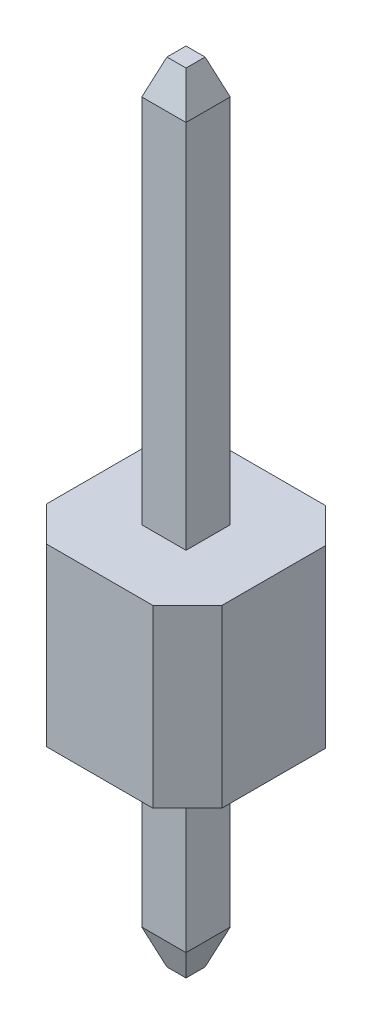
ISO-10303-21;
HEADER;
FILE_DESCRIPTION(('STEP AP214'),'2;1');
FILE_NAME('part.step','',(''),(''),'','','');
FILE_SCHEMA(('AUTOMOTIVE_DESIGN { 1 0 10303 214 1 1 1 1 }'));
ENDSEC;
DATA;
#1=APPLICATION_CONTEXT('core data for automotive mechanical design processes');
#2=APPLICATION_PROTOCOL_DEFINITION('international standard','automotive_design',2000,#1);
#3=PRODUCT_CONTEXT('',#1,'mechanical');
#4=PRODUCT('Part','Part','',(#3));
#5=PRODUCT_RELATED_PRODUCT_CATEGORY('part','',(#4));
#6=PRODUCT_DEFINITION_FORMATION('','',#4);
#7=PRODUCT_DEFINITION_CONTEXT('part definition',#1,'design');
#8=PRODUCT_DEFINITION('design','',#6,#7);
#9=PRODUCT_DEFINITION_SHAPE('','',#8);
#10=(LENGTH_UNIT() NAMED_UNIT(*) SI_UNIT(.MILLI.,.METRE.));
#11=(NAMED_UNIT(*) PLANE_ANGLE_UNIT() SI_UNIT($,.RADIAN.));
#12=(NAMED_UNIT(*) SI_UNIT($,.STERADIAN.) SOLID_ANGLE_UNIT());
#13=UNCERTAINTY_MEASURE_WITH_UNIT(LENGTH_MEASURE(1.E-05),#10,'distance_accuracy_value','');
#14=(GEOMETRIC_REPRESENTATION_CONTEXT(3) GLOBAL_UNCERTAINTY_ASSIGNED_CONTEXT((#13)) GLOBAL_UNIT_ASSIGNED_CONTEXT((#10,
#11,#12)) REPRESENTATION_CONTEXT('',''));
#15=CARTESIAN_POINT('',(0.,0.,0.));
#16=DIRECTION('',(0.,0.,1.));
#17=DIRECTION('',(1.,0.,0.));
#18=AXIS2_PLACEMENT_3D('',#15,#16,#17);
#19=CARTESIAN_POINT('',(-20.5046575219933,-116.166087876259,67.0858140827478));
#20=DIRECTION('',(0.,0.342020143325667,-0.939692620785909));
#21=DIRECTION('',(-1.,0.,0.));
#22=AXIS2_PLACEMENT_3D('',#19,#20,#21);
#23=PLANE('',#22);
#24=DIRECTION('',(0.323615577118189,0.889126490715985,0.323615577118189));
#25=VECTOR('',#24,1.);
#26=CARTESIAN_POINT('',(-20.381096529517,-116.205799613767,67.0713601923572));
#27=LINE('',#26,#25);
#28=CARTESIAN_POINT('',(-20.3666426391264,-116.166087876259,67.0858140827478));
#29=VERTEX_POINT('',#28);
#30=CARTESIAN_POINT('',(-20.1846575219933,-115.666087876259,67.2677991998809));
#31=VERTEX_POINT('',#30);
#32=EDGE_CURVE('E40',#29,#31,#27,.T.);
#33=ORIENTED_EDGE('',*,*,#32,.T.);
#34=DIRECTION('',(1.,0.,0.));
#35=VECTOR('',#34,1.);
#36=CARTESIAN_POINT('',(-20.1846575219833,-115.666087876269,67.2677991998909));
#37=LINE('',#36,#35);
#38=CARTESIAN_POINT('',(-20.8246575219933,-115.666087876259,67.2677991998809));
#39=VERTEX_POINT('',#38);
#40=EDGE_CURVE('E11',#39,#31,#37,.T.);
#41=ORIENTED_EDGE('',*,*,#40,.F.);
#42=DIRECTION('',(0.323615577118189,-0.889126490715985,-0.323615577118189));
#43=VECTOR('',#42,1.);
#44=CARTESIAN_POINT('',(-20.6282185144696,-116.205799613767,67.0713601923572));
#45=LINE('',#44,#43);
#46=CARTESIAN_POINT('',(-20.6426724048602,-116.166087876259,67.0858140827478));
#47=VERTEX_POINT('',#46);
#48=EDGE_CURVE('E240',#39,#47,#45,.T.);
#49=ORIENTED_EDGE('',*,*,#48,.T.);
#50=DIRECTION('',(-1.,0.,0.));
#51=VECTOR('',#50,1.);
#52=CARTESIAN_POINT('',(-20.5046575219933,-116.166087876269,67.0858140827578));
#53=LINE('',#52,#51);
#54=EDGE_CURVE('E245',#29,#47,#53,.T.);
#55=ORIENTED_EDGE('',*,*,#54,.F.);
#56=EDGE_LOOP('',(#33,#41,#49,#55));
#57=FACE_BOUND('',#56,.T.);
#58=ADVANCED_FACE('F16',(#57),#23,.F.);
#59=CARTESIAN_POINT('',(-20.1846575219933,-104.766087876259,67.2677991998809));
#60=DIRECTION('',(0.,0.,-1.));
#61=DIRECTION('',(0.,-1.,0.));
#62=AXIS2_PLACEMENT_3D('',#59,#60,#61);
#63=PLANE('',#62);
#64=DIRECTION('',(1.,0.,0.));
#65=VECTOR('',#64,1.);
#66=CARTESIAN_POINT('',(-20.1846575219833,-113.166087876259,67.2677991998909));
#67=LINE('',#66,#65);
#68=CARTESIAN_POINT('',(-20.8246575219933,-113.166087876259,67.2677991998809));
#69=VERTEX_POINT('',#68);
#70=CARTESIAN_POINT('',(-20.1846575219933,-113.166087876259,67.2677991998809));
#71=VERTEX_POINT('',#70);
#72=EDGE_CURVE('E270',#69,#71,#67,.T.);
#73=ORIENTED_EDGE('',*,*,#72,.F.);
#74=DIRECTION('',(0.,-1.,0.));
#75=VECTOR('',#74,1.);
#76=CARTESIAN_POINT('',(-20.8246575220033,-104.766087876249,67.2677991998909));
#77=LINE('',#76,#75);
#78=EDGE_CURVE('E197',#69,#39,#77,.T.);
#79=ORIENTED_EDGE('',*,*,#78,.T.);
#80=ORIENTED_EDGE('',*,*,#40,.T.);
#81=DIRECTION('',(0.,-1.,0.));
#82=VECTOR('',#81,1.);
#83=CARTESIAN_POINT('',(-20.1846575219833,-104.766087876249,67.2677991998909));
#84=LINE('',#83,#82);
#85=EDGE_CURVE('E288',#71,#31,#84,.T.);
#86=ORIENTED_EDGE('',*,*,#85,.F.);
#87=EDGE_LOOP('',(#73,#79,#80,#86));
#88=FACE_BOUND('',#87,.T.);
#89=ADVANCED_FACE('F458',(#88),#63,.F.);
#90=CARTESIAN_POINT('',(-20.1846575219933,-104.766087876259,67.2677991998809));
#91=DIRECTION('',(0.,0.,-1.));
#92=DIRECTION('',(0.,-1.,0.));
#93=AXIS2_PLACEMENT_3D('',#90,#91,#92);
#94=PLANE('',#93);
#95=DIRECTION('',(0.,-1.,0.));
#96=VECTOR('',#95,1.);
#97=CARTESIAN_POINT('',(-20.8246575220033,-104.766087876249,67.2677991998909));
#98=LINE('',#97,#96);
#99=CARTESIAN_POINT('',(-20.8246575219933,-105.266087876259,67.2677991998809));
#100=VERTEX_POINT('',#99);
#101=CARTESIAN_POINT('',(-20.8246575219933,-110.626087876259,67.2677991998809));
#102=VERTEX_POINT('',#101);
#103=EDGE_CURVE('E26',#100,#102,#98,.T.);
#104=ORIENTED_EDGE('',*,*,#103,.T.);
#105=DIRECTION('',(1.,0.,0.));
#106=VECTOR('',#105,1.);
#107=CARTESIAN_POINT('',(-20.1846575219833,-110.626087876249,67.2677991998909));
#108=LINE('',#107,#106);
#109=CARTESIAN_POINT('',(-20.1846575219933,-110.626087876259,67.2677991998809));
#110=VERTEX_POINT('',#109);
#111=EDGE_CURVE('E229',#102,#110,#108,.T.);
#112=ORIENTED_EDGE('',*,*,#111,.T.);
#113=DIRECTION('',(0.,-1.,0.));
#114=VECTOR('',#113,1.);
#115=CARTESIAN_POINT('',(-20.1846575219833,-104.766087876249,67.2677991998909));
#116=LINE('',#115,#114);
#117=CARTESIAN_POINT('',(-20.1846575219933,-105.266087876259,67.2677991998809));
#118=VERTEX_POINT('',#117);
#119=EDGE_CURVE('E301',#118,#110,#116,.T.);
#120=ORIENTED_EDGE('',*,*,#119,.F.);
#121=DIRECTION('',(-1.,0.,0.));
#122=VECTOR('',#121,1.);
#123=CARTESIAN_POINT('',(-20.8246575220033,-105.266087876249,67.2677991998909));
#124=LINE('',#123,#122);
#125=EDGE_CURVE('E246',#118,#100,#124,.T.);
#126=ORIENTED_EDGE('',*,*,#125,.T.);
#127=EDGE_LOOP('',(#104,#112,#120,#126));
#128=FACE_BOUND('',#127,.T.);
#129=ADVANCED_FACE('F464',(#128),#94,.F.);
#130=CARTESIAN_POINT('',(-20.5046575219933,-104.766087876259,66.9477991998809));
#131=DIRECTION('',(0.,1.,0.));
#132=DIRECTION('',(1.,0.,0.));
#133=AXIS2_PLACEMENT_3D('',#130,#131,#132);
#134=PLANE('',#133);
#135=DIRECTION('',(-1.,0.,0.));
#136=VECTOR('',#135,1.);
#137=CARTESIAN_POINT('',(-20.8246575220033,-104.766087876249,66.809784317004));
#138=LINE('',#137,#136);
#139=CARTESIAN_POINT('',(-20.3666426391264,-104.766087876259,66.809784317014));
#140=VERTEX_POINT('',#139);
#141=CARTESIAN_POINT('',(-20.6426724048602,-104.766087876259,66.809784317014));
#142=VERTEX_POINT('',#141);
#143=EDGE_CURVE('E239',#140,#142,#138,.T.);
#144=ORIENTED_EDGE('',*,*,#143,.T.);
#145=DIRECTION('',(0.,0.,1.));
#146=VECTOR('',#145,1.);
#147=CARTESIAN_POINT('',(-20.6426724048702,-104.766087876249,67.2677991998909));
#148=LINE('',#147,#146);
#149=CARTESIAN_POINT('',(-20.6426724048602,-104.766087876259,67.0858140827478));
#150=VERTEX_POINT('',#149);
#151=EDGE_CURVE('E304',#142,#150,#148,.T.);
#152=ORIENTED_EDGE('',*,*,#151,.T.);
#153=DIRECTION('',(1.,0.,0.));
#154=VECTOR('',#153,1.);
#155=CARTESIAN_POINT('',(-20.1846575219833,-104.766087876249,67.0858140827578));
#156=LINE('',#155,#154);
#157=CARTESIAN_POINT('',(-20.3666426391264,-104.766087876259,67.0858140827478));
#158=VERTEX_POINT('',#157);
#159=EDGE_CURVE('E253',#150,#158,#156,.T.);
#160=ORIENTED_EDGE('',*,*,#159,.T.);
#161=DIRECTION('',(0.,0.,-1.));
#162=VECTOR('',#161,1.);
#163=CARTESIAN_POINT('',(-20.3666426391164,-104.766087876249,66.6277991998709));
#164=LINE('',#163,#162);
#165=EDGE_CURVE('E269',#158,#140,#164,.T.);
#166=ORIENTED_EDGE('',*,*,#165,.T.);
#167=EDGE_LOOP('',(#144,#152,#160,#166));
#168=FACE_BOUND('',#167,.T.);
#169=ADVANCED_FACE('F472',(#168),#134,.T.);
#170=CARTESIAN_POINT('',(-20.8246575219933,-104.766087876259,67.2677991998809));
#171=DIRECTION('',(1.,0.,0.));
#172=DIRECTION('',(0.,0.,1.));
#173=AXIS2_PLACEMENT_3D('',#170,#171,#172);
#174=PLANE('',#173);
#175=DIRECTION('',(0.,-1.,0.));
#176=VECTOR('',#175,1.);
#177=CARTESIAN_POINT('',(-20.8246575220033,-104.766087876249,66.6277991998709));
#178=LINE('',#177,#176);
#179=CARTESIAN_POINT('',(-20.8246575219933,-105.266087876259,66.6277991998809));
#180=VERTEX_POINT('',#179);
#181=CARTESIAN_POINT('',(-20.8246575219933,-110.626087876259,66.6277991998809));
#182=VERTEX_POINT('',#181);
#183=EDGE_CURVE('E230',#180,#182,#178,.T.);
#184=ORIENTED_EDGE('',*,*,#183,.T.);
#185=DIRECTION('',(0.,0.,1.));
#186=VECTOR('',#185,1.);
#187=CARTESIAN_POINT('',(-20.8246575220033,-110.626087876249,67.2677991998909));
#188=LINE('',#187,#186);
#189=EDGE_CURVE('E225',#182,#102,#188,.T.);
#190=ORIENTED_EDGE('',*,*,#189,.T.);
#191=ORIENTED_EDGE('',*,*,#103,.F.);
#192=DIRECTION('',(0.,0.,-1.));
#193=VECTOR('',#192,1.);
#194=CARTESIAN_POINT('',(-20.8246575220033,-105.266087876249,66.6277991998709));
#195=LINE('',#194,#193);
#196=EDGE_CURVE('E392',#100,#180,#195,.T.);
#197=ORIENTED_EDGE('',*,*,#196,.T.);
#198=EDGE_LOOP('',(#184,#190,#191,#197));
#199=FACE_BOUND('',#198,.T.);
#200=ADVANCED_FACE('F469',(#199),#174,.F.);
#201=CARTESIAN_POINT('',(-20.3666426391264,-104.766087876259,66.9477991998809));
#202=DIRECTION('',(0.939692620785909,0.342020143325666,0.));
#203=DIRECTION('',(0.,0.,-1.));
#204=AXIS2_PLACEMENT_3D('',#201,#202,#203);
#205=PLANE('',#204);
#206=DIRECTION('',(-0.323615577118188,0.889126490715986,-0.323615577118188));
#207=VECTOR('',#206,1.);
#208=CARTESIAN_POINT('',(-20.381096529517,-104.72637613875,67.0713601923572));
#209=LINE('',#208,#207);
#210=EDGE_CURVE('E257',#118,#158,#209,.T.);
#211=ORIENTED_EDGE('',*,*,#210,.F.);
#212=DIRECTION('',(0.,0.,1.));
#213=VECTOR('',#212,1.);
#214=CARTESIAN_POINT('',(-20.1846575219833,-105.266087876249,67.2677991998909));
#215=LINE('',#214,#213);
#216=CARTESIAN_POINT('',(-20.1846575219933,-105.266087876259,66.6277991998809));
#217=VERTEX_POINT('',#216);
#218=EDGE_CURVE('E235',#217,#118,#215,.T.);
#219=ORIENTED_EDGE('',*,*,#218,.F.);
#220=DIRECTION('',(0.323615577118188,-0.889126490715986,-0.323615577118188));
#221=VECTOR('',#220,1.);
#222=CARTESIAN_POINT('',(-20.381096529517,-104.72637613875,66.8242382074046));
#223=LINE('',#222,#221);
#224=EDGE_CURVE('E236',#140,#217,#223,.T.);
#225=ORIENTED_EDGE('',*,*,#224,.F.);
#226=ORIENTED_EDGE('',*,*,#165,.F.);
#227=EDGE_LOOP('',(#211,#219,#225,#226));
#228=FACE_BOUND('',#227,.T.);
#229=ADVANCED_FACE('F453',(#228),#205,.T.);
#230=CARTESIAN_POINT('',(-20.5046575219933,-116.166087876259,66.809784317014));
#231=DIRECTION('',(0.,0.342020143325667,0.939692620785909));
#232=DIRECTION('',(1.,0.,0.));
#233=AXIS2_PLACEMENT_3D('',#230,#231,#232);
#234=PLANE('',#233);
#235=DIRECTION('',(0.323615577118189,-0.889126490715985,0.323615577118189));
#236=VECTOR('',#235,1.);
#237=CARTESIAN_POINT('',(-20.6282185144696,-116.205799613767,66.8242382074046));
#238=LINE('',#237,#236);
#239=CARTESIAN_POINT('',(-20.8246575219933,-115.666087876259,66.6277991998809));
#240=VERTEX_POINT('',#239);
#241=CARTESIAN_POINT('',(-20.6426724048602,-116.166087876259,66.809784317014));
#242=VERTEX_POINT('',#241);
#243=EDGE_CURVE('E327',#240,#242,#238,.T.);
#244=ORIENTED_EDGE('',*,*,#243,.F.);
#245=DIRECTION('',(-1.,0.,0.));
#246=VECTOR('',#245,1.);
#247=CARTESIAN_POINT('',(-20.1846575219833,-115.666087876269,66.6277991998709));
#248=LINE('',#247,#246);
#249=CARTESIAN_POINT('',(-20.1846575219933,-115.666087876259,66.6277991998809));
#250=VERTEX_POINT('',#249);
#251=EDGE_CURVE('E261',#250,#240,#248,.T.);
#252=ORIENTED_EDGE('',*,*,#251,.F.);
#253=DIRECTION('',(0.323615577118189,0.889126490715985,-0.323615577118189));
#254=VECTOR('',#253,1.);
#255=CARTESIAN_POINT('',(-20.381096529517,-116.205799613767,66.8242382074046));
#256=LINE('',#255,#254);
#257=CARTESIAN_POINT('',(-20.3666426391264,-116.166087876259,66.809784317014));
#258=VERTEX_POINT('',#257);
#259=EDGE_CURVE('E54',#258,#250,#256,.T.);
#260=ORIENTED_EDGE('',*,*,#259,.F.);
#261=DIRECTION('',(1.,0.,0.));
#262=VECTOR('',#261,1.);
#263=CARTESIAN_POINT('',(-20.5046575219933,-116.166087876269,66.809784317004));
#264=LINE('',#263,#262);
#265=EDGE_CURVE('E300',#242,#258,#264,.T.);
#266=ORIENTED_EDGE('',*,*,#265,.F.);
#267=EDGE_LOOP('',(#244,#252,#260,#266));
#268=FACE_BOUND('',#267,.T.);
#269=ADVANCED_FACE('F444',(#268),#234,.F.);
#270=CARTESIAN_POINT('',(-20.3666426391264,-116.166087876259,66.9477991998809));
#271=DIRECTION('',(-0.939692620785909,0.342020143325667,0.));
#272=DIRECTION('',(0.,0.,1.));
#273=AXIS2_PLACEMENT_3D('',#270,#271,#272);
#274=PLANE('',#273);
#275=ORIENTED_EDGE('',*,*,#259,.T.);
#276=DIRECTION('',(0.,0.,-1.));
#277=VECTOR('',#276,1.);
#278=CARTESIAN_POINT('',(-20.1846575219833,-115.666087876269,67.2677991998909));
#279=LINE('',#278,#277);
#280=EDGE_CURVE('E252',#31,#250,#279,.T.);
#281=ORIENTED_EDGE('',*,*,#280,.F.);
#282=ORIENTED_EDGE('',*,*,#32,.F.);
#283=DIRECTION('',(0.,0.,1.));
#284=VECTOR('',#283,1.);
#285=CARTESIAN_POINT('',(-20.3666426391164,-116.166087876269,66.9477991998909));
#286=LINE('',#285,#284);
#287=EDGE_CURVE('E241',#258,#29,#286,.T.);
#288=ORIENTED_EDGE('',*,*,#287,.F.);
#289=EDGE_LOOP('',(#275,#281,#282,#288));
#290=FACE_BOUND('',#289,.T.);
#291=ADVANCED_FACE('F442',(#290),#274,.F.);
#292=CARTESIAN_POINT('',(-20.5046575219933,-116.166087876259,66.9477991998809));
#293=DIRECTION('',(0.,1.,0.));
#294=DIRECTION('',(1.,0.,0.));
#295=AXIS2_PLACEMENT_3D('',#292,#293,#294);
#296=PLANE('',#295);
#297=ORIENTED_EDGE('',*,*,#287,.T.);
#298=ORIENTED_EDGE('',*,*,#54,.T.);
#299=DIRECTION('',(0.,0.,-1.));
#300=VECTOR('',#299,1.);
#301=CARTESIAN_POINT('',(-20.6426724048702,-116.166087876269,66.9477991998809));
#302=LINE('',#301,#300);
#303=EDGE_CURVE('E323',#47,#242,#302,.T.);
#304=ORIENTED_EDGE('',*,*,#303,.T.);
#305=ORIENTED_EDGE('',*,*,#265,.T.);
#306=EDGE_LOOP('',(#297,#298,#304,#305));
#307=FACE_BOUND('',#306,.T.);
#308=ADVANCED_FACE('F440',(#307),#296,.F.);
#309=CARTESIAN_POINT('',(-19.2346575219933,-110.626087876259,68.1977991998809));
#310=DIRECTION('',(0.,0.,-1.));
#311=DIRECTION('',(-1.,0.,0.));
#312=AXIS2_PLACEMENT_3D('',#309,#310,#311);
#313=PLANE('',#312);
#314=DIRECTION('',(1.,0.,0.));
#315=VECTOR('',#314,1.);
#316=CARTESIAN_POINT('',(-19.2346575219833,-110.626087876249,68.1977991998909));
#317=LINE('',#316,#315);
#318=CARTESIAN_POINT('',(-21.2746575219933,-110.626087876259,68.1977991998809));
#319=VERTEX_POINT('',#318);
#320=CARTESIAN_POINT('',(-19.7346575219933,-110.626087876259,68.1977991998809));
#321=VERTEX_POINT('',#320);
#322=EDGE_CURVE('E282',#319,#321,#317,.T.);
#323=ORIENTED_EDGE('',*,*,#322,.F.);
#324=DIRECTION('',(0.,-1.,0.));
#325=VECTOR('',#324,1.);
#326=CARTESIAN_POINT('',(-21.2746575220033,-110.626087876249,68.1977991998909));
#327=LINE('',#326,#325);
#328=CARTESIAN_POINT('',(-21.2746575219933,-113.166087876259,68.1977991998809));
#329=VERTEX_POINT('',#328);
#330=EDGE_CURVE('E258',#319,#329,#327,.T.);
#331=ORIENTED_EDGE('',*,*,#330,.T.);
#332=DIRECTION('',(1.,0.,0.));
#333=VECTOR('',#332,1.);
#334=CARTESIAN_POINT('',(-19.2346575219833,-113.166087876259,68.1977991998909));
#335=LINE('',#334,#333);
#336=CARTESIAN_POINT('',(-19.7346575219933,-113.166087876259,68.1977991998809));
#337=VERTEX_POINT('',#336);
#338=EDGE_CURVE('E328',#329,#337,#335,.T.);
#339=ORIENTED_EDGE('',*,*,#338,.T.);
#340=DIRECTION('',(0.,1.,0.));
#341=VECTOR('',#340,1.);
#342=CARTESIAN_POINT('',(-19.7346575219833,-110.626087876249,68.1977991998909));
#343=LINE('',#342,#341);
#344=EDGE_CURVE('E319',#337,#321,#343,.T.);
#345=ORIENTED_EDGE('',*,*,#344,.T.);
#346=EDGE_LOOP('',(#323,#331,#339,#345));
#347=FACE_BOUND('',#346,.T.);
#348=ADVANCED_FACE('F451',(#347),#313,.F.);
#349=CARTESIAN_POINT('',(-21.7746575219933,-110.626087876259,68.1977991998809));
#350=DIRECTION('',(1.,0.,0.));
#351=DIRECTION('',(0.,0.,1.));
#352=AXIS2_PLACEMENT_3D('',#349,#350,#351);
#353=PLANE('',#352);
#354=DIRECTION('',(0.,0.,1.));
#355=VECTOR('',#354,1.);
#356=CARTESIAN_POINT('',(-21.7746575220033,-113.166087876259,68.1977991998909));
#357=LINE('',#356,#355);
#358=CARTESIAN_POINT('',(-21.7746575219933,-113.166087876259,66.1977991998809));
#359=VERTEX_POINT('',#358);
#360=CARTESIAN_POINT('',(-21.7746575219933,-113.166087876259,67.6977991998809));
#361=VERTEX_POINT('',#360);
#362=EDGE_CURVE('E333',#359,#361,#357,.T.);
#363=ORIENTED_EDGE('',*,*,#362,.T.);
#364=DIRECTION('',(0.,1.,0.));
#365=VECTOR('',#364,1.);
#366=CARTESIAN_POINT('',(-21.7746575220033,-110.626087876249,67.6977991998909));
#367=LINE('',#366,#365);
#368=CARTESIAN_POINT('',(-21.7746575219933,-110.626087876259,67.6977991998809));
#369=VERTEX_POINT('',#368);
#370=EDGE_CURVE('E251',#361,#369,#367,.T.);
#371=ORIENTED_EDGE('',*,*,#370,.T.);
#372=DIRECTION('',(0.,0.,1.));
#373=VECTOR('',#372,1.);
#374=CARTESIAN_POINT('',(-21.7746575220033,-110.626087876249,68.1977991998909));
#375=LINE('',#374,#373);
#376=CARTESIAN_POINT('',(-21.7746575219933,-110.626087876259,66.1977991998809));
#377=VERTEX_POINT('',#376);
#378=EDGE_CURVE('E275',#377,#369,#375,.T.);
#379=ORIENTED_EDGE('',*,*,#378,.F.);
#380=DIRECTION('',(0.,-1.,0.));
#381=VECTOR('',#380,1.);
#382=CARTESIAN_POINT('',(-21.7746575220033,-110.626087876249,66.1977991998709));
#383=LINE('',#382,#381);
#384=EDGE_CURVE('E196',#377,#359,#383,.T.);
#385=ORIENTED_EDGE('',*,*,#384,.T.);
#386=EDGE_LOOP('',(#363,#371,#379,#385));
#387=FACE_BOUND('',#386,.T.);
#388=ADVANCED_FACE('F369',(#387),#353,.F.);
#389=CARTESIAN_POINT('',(-19.2346575219933,-110.626087876259,65.6977991998809));
#390=DIRECTION('',(0.,0.,1.));
#391=DIRECTION('',(1.,0.,0.));
#392=AXIS2_PLACEMENT_3D('',#389,#390,#391);
#393=PLANE('',#392);
#394=DIRECTION('',(-1.,0.,0.));
#395=VECTOR('',#394,1.);
#396=CARTESIAN_POINT('',(-19.2346575219833,-113.166087876259,65.6977991998709));
#397=LINE('',#396,#395);
#398=CARTESIAN_POINT('',(-19.7346575219933,-113.166087876259,65.6977991998809));
#399=VERTEX_POINT('',#398);
#400=CARTESIAN_POINT('',(-21.2746575219933,-113.166087876259,65.6977991998809));
#401=VERTEX_POINT('',#400);
#402=EDGE_CURVE('E191',#399,#401,#397,.T.);
#403=ORIENTED_EDGE('',*,*,#402,.T.);
#404=DIRECTION('',(0.,1.,0.));
#405=VECTOR('',#404,1.);
#406=CARTESIAN_POINT('',(-21.2746575220033,-110.626087876249,65.6977991998709));
#407=LINE('',#406,#405);
#408=CARTESIAN_POINT('',(-21.2746575219933,-110.626087876259,65.6977991998809));
#409=VERTEX_POINT('',#408);
#410=EDGE_CURVE('E185',#401,#409,#407,.T.);
#411=ORIENTED_EDGE('',*,*,#410,.T.);
#412=DIRECTION('',(-1.,0.,0.));
#413=VECTOR('',#412,1.);
#414=CARTESIAN_POINT('',(-19.2346575219833,-110.626087876249,65.6977991998709));
#415=LINE('',#414,#413);
#416=CARTESIAN_POINT('',(-19.7346575219933,-110.626087876259,65.6977991998809));
#417=VERTEX_POINT('',#416);
#418=EDGE_CURVE('E188',#417,#409,#415,.T.);
#419=ORIENTED_EDGE('',*,*,#418,.F.);
#420=DIRECTION('',(0.,-1.,0.));
#421=VECTOR('',#420,1.);
#422=CARTESIAN_POINT('',(-19.7346575219833,-110.626087876249,65.6977991998709));
#423=LINE('',#422,#421);
#424=EDGE_CURVE('E344',#417,#399,#423,.T.);
#425=ORIENTED_EDGE('',*,*,#424,.T.);
#426=EDGE_LOOP('',(#403,#411,#419,#425));
#427=FACE_BOUND('',#426,.T.);
#428=ADVANCED_FACE('F18',(#427),#393,.F.);
#429=CARTESIAN_POINT('',(-19.2346575219933,-110.626087876259,68.1977991998809));
#430=DIRECTION('',(-1.,0.,0.));
#431=DIRECTION('',(0.,0.,1.));
#432=AXIS2_PLACEMENT_3D('',#429,#430,#431);
#433=PLANE('',#432);
#434=DIRECTION('',(0.,0.,-1.));
#435=VECTOR('',#434,1.);
#436=CARTESIAN_POINT('',(-19.2346575219833,-110.626087876249,68.1977991998909));
#437=LINE('',#436,#435);
#438=CARTESIAN_POINT('',(-19.2346575219933,-110.626087876259,67.6977991998809));
#439=VERTEX_POINT('',#438);
#440=CARTESIAN_POINT('',(-19.2346575219933,-110.626087876259,66.1977991998809));
#441=VERTEX_POINT('',#440);
#442=EDGE_CURVE('E219',#439,#441,#437,.T.);
#443=ORIENTED_EDGE('',*,*,#442,.F.);
#444=DIRECTION('',(0.,-1.,0.));
#445=VECTOR('',#444,1.);
#446=CARTESIAN_POINT('',(-19.2346575219833,-110.626087876249,67.6977991998909));
#447=LINE('',#446,#445);
#448=CARTESIAN_POINT('',(-19.2346575219933,-113.166087876259,67.6977991998809));
#449=VERTEX_POINT('',#448);
#450=EDGE_CURVE('E322',#439,#449,#447,.T.);
#451=ORIENTED_EDGE('',*,*,#450,.T.);
#452=DIRECTION('',(0.,0.,-1.));
#453=VECTOR('',#452,1.);
#454=CARTESIAN_POINT('',(-19.2346575219833,-113.166087876259,68.1977991998909));
#455=LINE('',#454,#453);
#456=CARTESIAN_POINT('',(-19.2346575219933,-113.166087876259,66.1977991998809));
#457=VERTEX_POINT('',#456);
#458=EDGE_CURVE('E387',#449,#457,#455,.T.);
#459=ORIENTED_EDGE('',*,*,#458,.T.);
#460=DIRECTION('',(0.,1.,0.));
#461=VECTOR('',#460,1.);
#462=CARTESIAN_POINT('',(-19.2346575219833,-110.626087876249,66.1977991998709));
#463=LINE('',#462,#461);
#464=EDGE_CURVE('E347',#457,#441,#463,.T.);
#465=ORIENTED_EDGE('',*,*,#464,.T.);
#466=EDGE_LOOP('',(#443,#451,#459,#465));
#467=FACE_BOUND('',#466,.T.);
#468=ADVANCED_FACE('F527',(#467),#433,.F.);
#469=CARTESIAN_POINT('',(-20.5046575219933,-104.766087876259,67.0858140827478));
#470=DIRECTION('',(0.,0.342020143325666,0.939692620785909));
#471=DIRECTION('',(1.,0.,0.));
#472=AXIS2_PLACEMENT_3D('',#469,#470,#471);
#473=PLANE('',#472);
#474=ORIENTED_EDGE('',*,*,#210,.T.);
#475=ORIENTED_EDGE('',*,*,#159,.F.);
#476=DIRECTION('',(0.323615577118188,0.889126490715986,-0.323615577118188));
#477=VECTOR('',#476,1.);
#478=CARTESIAN_POINT('',(-20.6282185144696,-104.72637613875,67.0713601923572));
#479=LINE('',#478,#477);
#480=EDGE_CURVE('E314',#100,#150,#479,.T.);
#481=ORIENTED_EDGE('',*,*,#480,.F.);
#482=ORIENTED_EDGE('',*,*,#125,.F.);
#483=EDGE_LOOP('',(#474,#475,#481,#482));
#484=FACE_BOUND('',#483,.T.);
#485=ADVANCED_FACE('F834',(#484),#473,.T.);
#486=CARTESIAN_POINT('',(-20.5046575219933,-104.766087876259,66.809784317014));
#487=DIRECTION('',(0.,0.342020143325666,-0.939692620785909));
#488=DIRECTION('',(-1.,0.,0.));
#489=AXIS2_PLACEMENT_3D('',#486,#487,#488);
#490=PLANE('',#489);
#491=ORIENTED_EDGE('',*,*,#224,.T.);
#492=DIRECTION('',(1.,0.,0.));
#493=VECTOR('',#492,1.);
#494=CARTESIAN_POINT('',(-20.1846575219833,-105.266087876249,66.6277991998709));
#495=LINE('',#494,#493);
#496=EDGE_CURVE('E234',#180,#217,#495,.T.);
#497=ORIENTED_EDGE('',*,*,#496,.F.);
#498=DIRECTION('',(-0.323615577118188,-0.889126490715986,-0.323615577118188));
#499=VECTOR('',#498,1.);
#500=CARTESIAN_POINT('',(-20.6282185144696,-104.72637613875,66.8242382074046));
#501=LINE('',#500,#499);
#502=EDGE_CURVE('E310',#142,#180,#501,.T.);
#503=ORIENTED_EDGE('',*,*,#502,.F.);
#504=ORIENTED_EDGE('',*,*,#143,.F.);
#505=EDGE_LOOP('',(#491,#497,#503,#504));
#506=FACE_BOUND('',#505,.T.);
#507=ADVANCED_FACE('F478',(#506),#490,.T.);
#508=CARTESIAN_POINT('',(-20.6426724048602,-116.166087876259,66.9477991998809));
#509=DIRECTION('',(0.939692620785909,0.342020143325667,0.));
#510=DIRECTION('',(0.,0.,-1.));
#511=AXIS2_PLACEMENT_3D('',#508,#509,#510);
#512=PLANE('',#511);
#513=ORIENTED_EDGE('',*,*,#243,.T.);
#514=ORIENTED_EDGE('',*,*,#303,.F.);
#515=ORIENTED_EDGE('',*,*,#48,.F.);
#516=DIRECTION('',(0.,0.,1.));
#517=VECTOR('',#516,1.);
#518=CARTESIAN_POINT('',(-20.8246575220033,-115.666087876269,67.2677991998909));
#519=LINE('',#518,#517);
#520=EDGE_CURVE('E318',#240,#39,#519,.T.);
#521=ORIENTED_EDGE('',*,*,#520,.F.);
#522=EDGE_LOOP('',(#513,#514,#515,#521));
#523=FACE_BOUND('',#522,.T.);
#524=ADVANCED_FACE('F474',(#523),#512,.F.);
#525=CARTESIAN_POINT('',(-19.7346575219933,-110.626087876259,65.6977991998809));
#526=DIRECTION('',(-0.707106781186549,0.,0.707106781186546));
#527=DIRECTION('',(0.,1.,0.));
#528=AXIS2_PLACEMENT_3D('',#525,#526,#527);
#529=PLANE('',#528);
#530=DIRECTION('',(-0.707106781186546,0.,-0.707106781186549));
#531=VECTOR('',#530,1.);
#532=CARTESIAN_POINT('',(-19.4946575219833,-110.626087876249,65.9377991998709));
#533=LINE('',#532,#531);
#534=EDGE_CURVE('E211',#441,#417,#533,.T.);
#535=ORIENTED_EDGE('',*,*,#534,.F.);
#536=ORIENTED_EDGE('',*,*,#464,.F.);
#537=DIRECTION('',(0.707106781186546,0.,0.707106781186549));
#538=VECTOR('',#537,1.);
#539=CARTESIAN_POINT('',(-19.7346575219833,-113.166087876259,65.6977991998709));
#540=LINE('',#539,#538);
#541=EDGE_CURVE('E378',#399,#457,#540,.T.);
#542=ORIENTED_EDGE('',*,*,#541,.F.);
#543=ORIENTED_EDGE('',*,*,#424,.F.);
#544=EDGE_LOOP('',(#535,#536,#542,#543));
#545=FACE_BOUND('',#544,.T.);
#546=ADVANCED_FACE('F477',(#545),#529,.F.);
#547=CARTESIAN_POINT('',(-19.2346575219933,-110.626087876259,67.6977991998809));
#548=DIRECTION('',(-0.707106781186545,0.,-0.70710678118655));
#549=DIRECTION('',(-0.70710678118655,0.,0.707106781186545));
#550=AXIS2_PLACEMENT_3D('',#547,#548,#549);
#551=PLANE('',#550);
#552=DIRECTION('',(0.70710678118655,0.,-0.707106781186545));
#553=VECTOR('',#552,1.);
#554=CARTESIAN_POINT('',(-19.4946575219833,-110.626087876249,67.9577991998909));
#555=LINE('',#554,#553);
#556=EDGE_CURVE('E351',#321,#439,#555,.T.);
#557=ORIENTED_EDGE('',*,*,#556,.F.);
#558=ORIENTED_EDGE('',*,*,#344,.F.);
#559=DIRECTION('',(-0.70710678118655,0.,0.707106781186545));
#560=VECTOR('',#559,1.);
#561=CARTESIAN_POINT('',(-19.2346575219833,-113.166087876259,67.6977991998909));
#562=LINE('',#561,#560);
#563=EDGE_CURVE('E274',#449,#337,#562,.T.);
#564=ORIENTED_EDGE('',*,*,#563,.F.);
#565=ORIENTED_EDGE('',*,*,#450,.F.);
#566=EDGE_LOOP('',(#557,#558,#564,#565));
#567=FACE_BOUND('',#566,.T.);
#568=ADVANCED_FACE('F523',(#567),#551,.F.);
#569=CARTESIAN_POINT('',(-21.7746575219933,-110.626087876259,66.1977991998809));
#570=DIRECTION('',(0.707106781186546,0.,0.707106781186549));
#571=DIRECTION('',(0.,-1.,0.));
#572=AXIS2_PLACEMENT_3D('',#569,#570,#571);
#573=PLANE('',#572);
#574=DIRECTION('',(-0.707106781186549,0.,0.707106781186546));
#575=VECTOR('',#574,1.);
#576=CARTESIAN_POINT('',(-21.5146575220033,-110.626087876249,65.9377991998709));
#577=LINE('',#576,#575);
#578=EDGE_CURVE('E200',#409,#377,#577,.T.);
#579=ORIENTED_EDGE('',*,*,#578,.F.);
#580=ORIENTED_EDGE('',*,*,#410,.F.);
#581=DIRECTION('',(0.707106781186549,0.,-0.707106781186546));
#582=VECTOR('',#581,1.);
#583=CARTESIAN_POINT('',(-21.7746575220033,-113.166087876259,66.1977991998709));
#584=LINE('',#583,#582);
#585=EDGE_CURVE('E336',#359,#401,#584,.T.);
#586=ORIENTED_EDGE('',*,*,#585,.F.);
#587=ORIENTED_EDGE('',*,*,#384,.F.);
#588=EDGE_LOOP('',(#579,#580,#586,#587));
#589=FACE_BOUND('',#588,.T.);
#590=ADVANCED_FACE('F201',(#589),#573,.F.);
#591=CARTESIAN_POINT('',(-20.8246575219933,-104.766087876259,67.2677991998809));
#592=DIRECTION('',(1.,0.,0.));
#593=DIRECTION('',(0.,0.,1.));
#594=AXIS2_PLACEMENT_3D('',#591,#592,#593);
#595=PLANE('',#594);
#596=DIRECTION('',(0.,0.,1.));
#597=VECTOR('',#596,1.);
#598=CARTESIAN_POINT('',(-20.8246575220033,-113.166087876259,67.2677991998909));
#599=LINE('',#598,#597);
#600=CARTESIAN_POINT('',(-20.8246575219933,-113.166087876259,66.6277991998809));
#601=VERTEX_POINT('',#600);
#602=EDGE_CURVE('E287',#601,#69,#599,.T.);
#603=ORIENTED_EDGE('',*,*,#602,.F.);
#604=DIRECTION('',(0.,-1.,0.));
#605=VECTOR('',#604,1.);
#606=CARTESIAN_POINT('',(-20.8246575220033,-104.766087876249,66.6277991998709));
#607=LINE('',#606,#605);
#608=EDGE_CURVE('E396',#601,#240,#607,.T.);
#609=ORIENTED_EDGE('',*,*,#608,.T.);
#610=ORIENTED_EDGE('',*,*,#520,.T.);
#611=ORIENTED_EDGE('',*,*,#78,.F.);
#612=EDGE_LOOP('',(#603,#609,#610,#611));
#613=FACE_BOUND('',#612,.T.);
#614=ADVANCED_FACE('F719',(#613),#595,.F.);
#615=CARTESIAN_POINT('',(-20.1846575219933,-104.766087876259,66.6277991998809));
#616=DIRECTION('',(0.,0.,1.));
#617=DIRECTION('',(1.,0.,0.));
#618=AXIS2_PLACEMENT_3D('',#615,#616,#617);
#619=PLANE('',#618);
#620=DIRECTION('',(-1.,0.,0.));
#621=VECTOR('',#620,1.);
#622=CARTESIAN_POINT('',(-20.1846575219833,-113.166087876259,66.6277991998709));
#623=LINE('',#622,#621);
#624=CARTESIAN_POINT('',(-20.1846575219933,-113.166087876259,66.6277991998809));
#625=VERTEX_POINT('',#624);
#626=EDGE_CURVE('E283',#625,#601,#623,.T.);
#627=ORIENTED_EDGE('',*,*,#626,.F.);
#628=DIRECTION('',(0.,-1.,0.));
#629=VECTOR('',#628,1.);
#630=CARTESIAN_POINT('',(-20.1846575219833,-104.766087876249,66.6277991998709));
#631=LINE('',#630,#629);
#632=EDGE_CURVE('E247',#625,#250,#631,.T.);
#633=ORIENTED_EDGE('',*,*,#632,.T.);
#634=ORIENTED_EDGE('',*,*,#251,.T.);
#635=ORIENTED_EDGE('',*,*,#608,.F.);
#636=EDGE_LOOP('',(#627,#633,#634,#635));
#637=FACE_BOUND('',#636,.T.);
#638=ADVANCED_FACE('F716',(#637),#619,.F.);
#639=CARTESIAN_POINT('',(-21.2746575219933,-110.626087876259,68.1977991998809));
#640=DIRECTION('',(0.707106781186548,0.,-0.707106781186548));
#641=DIRECTION('',(0.,-1.,0.));
#642=AXIS2_PLACEMENT_3D('',#639,#640,#641);
#643=PLANE('',#642);
#644=DIRECTION('',(0.707106781186548,0.,0.707106781186548));
#645=VECTOR('',#644,1.);
#646=CARTESIAN_POINT('',(-21.5146575220033,-110.626087876249,67.9577991998909));
#647=LINE('',#646,#645);
#648=EDGE_CURVE('E278',#369,#319,#647,.T.);
#649=ORIENTED_EDGE('',*,*,#648,.F.);
#650=ORIENTED_EDGE('',*,*,#370,.F.);
#651=DIRECTION('',(-0.707106781186548,0.,-0.707106781186548));
#652=VECTOR('',#651,1.);
#653=CARTESIAN_POINT('',(-21.2746575220033,-113.166087876259,68.1977991998909));
#654=LINE('',#653,#652);
#655=EDGE_CURVE('E332',#329,#361,#654,.T.);
#656=ORIENTED_EDGE('',*,*,#655,.F.);
#657=ORIENTED_EDGE('',*,*,#330,.F.);
#658=EDGE_LOOP('',(#649,#650,#656,#657));
#659=FACE_BOUND('',#658,.T.);
#660=ADVANCED_FACE('F366',(#659),#643,.F.);
#661=CARTESIAN_POINT('',(-20.1846575219933,-104.766087876259,67.2677991998809));
#662=DIRECTION('',(-1.,0.,0.));
#663=DIRECTION('',(0.,0.,1.));
#664=AXIS2_PLACEMENT_3D('',#661,#662,#663);
#665=PLANE('',#664);
#666=DIRECTION('',(0.,0.,-1.));
#667=VECTOR('',#666,1.);
#668=CARTESIAN_POINT('',(-20.1846575219833,-113.166087876259,67.2677991998909));
#669=LINE('',#668,#667);
#670=EDGE_CURVE('E223',#71,#625,#669,.T.);
#671=ORIENTED_EDGE('',*,*,#670,.F.);
#672=ORIENTED_EDGE('',*,*,#85,.T.);
#673=ORIENTED_EDGE('',*,*,#280,.T.);
#674=ORIENTED_EDGE('',*,*,#632,.F.);
#675=EDGE_LOOP('',(#671,#672,#673,#674));
#676=FACE_BOUND('',#675,.T.);
#677=ADVANCED_FACE('F542',(#676),#665,.F.);
#678=CARTESIAN_POINT('',(-20.1846575219933,-104.766087876259,66.6277991998809));
#679=DIRECTION('',(0.,0.,1.));
#680=DIRECTION('',(1.,0.,0.));
#681=AXIS2_PLACEMENT_3D('',#678,#679,#680);
#682=PLANE('',#681);
#683=DIRECTION('',(0.,-1.,0.));
#684=VECTOR('',#683,1.);
#685=CARTESIAN_POINT('',(-20.1846575219833,-104.766087876249,66.6277991998709));
#686=LINE('',#685,#684);
#687=CARTESIAN_POINT('',(-20.1846575219933,-110.626087876259,66.6277991998809));
#688=VERTEX_POINT('',#687);
#689=EDGE_CURVE('E20',#217,#688,#686,.T.);
#690=ORIENTED_EDGE('',*,*,#689,.T.);
#691=DIRECTION('',(-1.,0.,0.));
#692=VECTOR('',#691,1.);
#693=CARTESIAN_POINT('',(-20.1846575219833,-110.626087876249,66.6277991998709));
#694=LINE('',#693,#692);
#695=EDGE_CURVE('E228',#688,#182,#694,.T.);
#696=ORIENTED_EDGE('',*,*,#695,.T.);
#697=ORIENTED_EDGE('',*,*,#183,.F.);
#698=ORIENTED_EDGE('',*,*,#496,.T.);
#699=EDGE_LOOP('',(#690,#696,#697,#698));
#700=FACE_BOUND('',#699,.T.);
#701=ADVANCED_FACE('F485',(#700),#682,.F.);
#702=CARTESIAN_POINT('',(-20.1846575219933,-104.766087876259,67.2677991998809));
#703=DIRECTION('',(-1.,0.,0.));
#704=DIRECTION('',(0.,0.,1.));
#705=AXIS2_PLACEMENT_3D('',#702,#703,#704);
#706=PLANE('',#705);
#707=ORIENTED_EDGE('',*,*,#119,.T.);
#708=DIRECTION('',(0.,0.,-1.));
#709=VECTOR('',#708,1.);
#710=CARTESIAN_POINT('',(-20.1846575219833,-110.626087876249,67.2677991998909));
#711=LINE('',#710,#709);
#712=EDGE_CURVE('E206',#110,#688,#711,.T.);
#713=ORIENTED_EDGE('',*,*,#712,.T.);
#714=ORIENTED_EDGE('',*,*,#689,.F.);
#715=ORIENTED_EDGE('',*,*,#218,.T.);
#716=EDGE_LOOP('',(#707,#713,#714,#715));
#717=FACE_BOUND('',#716,.T.);
#718=ADVANCED_FACE('F482',(#717),#706,.F.);
#719=CARTESIAN_POINT('',(-20.6426724048602,-104.766087876259,66.9477991998809));
#720=DIRECTION('',(-0.939692620785909,0.342020143325666,0.));
#721=DIRECTION('',(0.,0.,1.));
#722=AXIS2_PLACEMENT_3D('',#719,#720,#721);
#723=PLANE('',#722);
#724=ORIENTED_EDGE('',*,*,#502,.T.);
#725=ORIENTED_EDGE('',*,*,#196,.F.);
#726=ORIENTED_EDGE('',*,*,#480,.T.);
#727=ORIENTED_EDGE('',*,*,#151,.F.);
#728=EDGE_LOOP('',(#724,#725,#726,#727));
#729=FACE_BOUND('',#728,.T.);
#730=ADVANCED_FACE('F484',(#729),#723,.T.);
#731=CARTESIAN_POINT('',(-20.5046575219933,-113.166087876259,66.9477991998809));
#732=DIRECTION('',(0.,1.,0.));
#733=DIRECTION('',(1.,0.,0.));
#734=AXIS2_PLACEMENT_3D('',#731,#732,#733);
#735=PLANE('',#734);
#736=ORIENTED_EDGE('',*,*,#72,.T.);
#737=ORIENTED_EDGE('',*,*,#670,.T.);
#738=ORIENTED_EDGE('',*,*,#626,.T.);
#739=ORIENTED_EDGE('',*,*,#602,.T.);
#740=EDGE_LOOP('',(#736,#737,#738,#739));
#741=FACE_BOUND('',#740,.T.);
#742=ORIENTED_EDGE('',*,*,#338,.F.);
#743=ORIENTED_EDGE('',*,*,#655,.T.);
#744=ORIENTED_EDGE('',*,*,#362,.F.);
#745=ORIENTED_EDGE('',*,*,#585,.T.);
#746=ORIENTED_EDGE('',*,*,#402,.F.);
#747=ORIENTED_EDGE('',*,*,#541,.T.);
#748=ORIENTED_EDGE('',*,*,#458,.F.);
#749=ORIENTED_EDGE('',*,*,#563,.T.);
#750=EDGE_LOOP('',(#742,#743,#744,#745,#746,#747,#748,#749));
#751=FACE_BOUND('',#750,.T.);
#752=ADVANCED_FACE('F362',(#741,#751),#735,.F.);
#753=CARTESIAN_POINT('',(-20.5046575219933,-110.626087876259,66.9477991998809));
#754=DIRECTION('',(0.,1.,0.));
#755=DIRECTION('',(1.,0.,0.));
#756=AXIS2_PLACEMENT_3D('',#753,#754,#755);
#757=PLANE('',#756);
#758=ORIENTED_EDGE('',*,*,#712,.F.);
#759=ORIENTED_EDGE('',*,*,#111,.F.);
#760=ORIENTED_EDGE('',*,*,#189,.F.);
#761=ORIENTED_EDGE('',*,*,#695,.F.);
#762=EDGE_LOOP('',(#758,#759,#760,#761));
#763=FACE_BOUND('',#762,.T.);
#764=ORIENTED_EDGE('',*,*,#378,.T.);
#765=ORIENTED_EDGE('',*,*,#648,.T.);
#766=ORIENTED_EDGE('',*,*,#322,.T.);
#767=ORIENTED_EDGE('',*,*,#556,.T.);
#768=ORIENTED_EDGE('',*,*,#442,.T.);
#769=ORIENTED_EDGE('',*,*,#534,.T.);
#770=ORIENTED_EDGE('',*,*,#418,.T.);
#771=ORIENTED_EDGE('',*,*,#578,.T.);
#772=EDGE_LOOP('',(#764,#765,#766,#767,#768,#769,#770,#771));
#773=FACE_BOUND('',#772,.T.);
#774=ADVANCED_FACE('F208',(#763,#773),#757,.T.);
#775=CLOSED_SHELL('',(#58,#89,#129,#169,#200,#229,#269,#291,#308,#348,#388,#428,#468,#485,#507,
#524,#546,#568,#590,#614,#638,#660,#677,#701,#718,#730,#752,#774));
#776=MANIFOLD_SOLID_BREP('B1',#775);
#777=ADVANCED_BREP_SHAPE_REPRESENTATION('',(#18,#776),#14);
#778=SHAPE_DEFINITION_REPRESENTATION(#9,#777);
ENDSEC;
END-ISO-10303-21;
